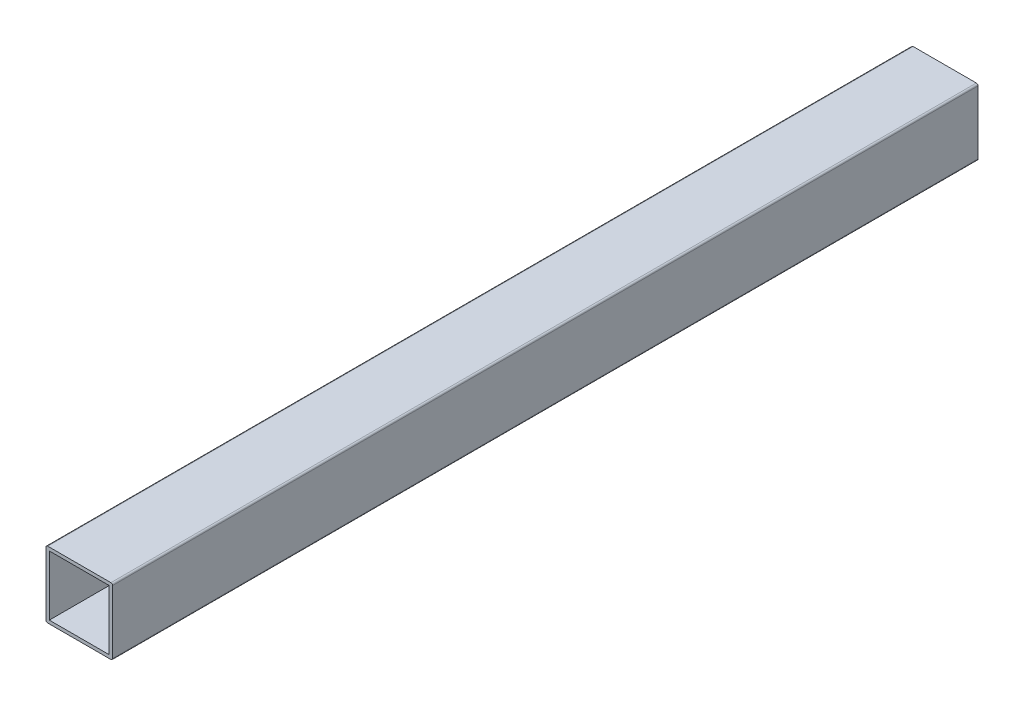
ISO-10303-21;
HEADER;
FILE_DESCRIPTION(('STEP AP214'),'2;1');
FILE_NAME('part.step','',(''),(''),'','','');
FILE_SCHEMA(('AUTOMOTIVE_DESIGN { 1 0 10303 214 1 1 1 1 }'));
ENDSEC;
DATA;
#1=APPLICATION_CONTEXT('core data for automotive mechanical design processes');
#2=APPLICATION_PROTOCOL_DEFINITION('international standard','automotive_design',2000,#1);
#3=PRODUCT_CONTEXT('',#1,'mechanical');
#4=PRODUCT('Part','Part','',(#3));
#5=PRODUCT_RELATED_PRODUCT_CATEGORY('part','',(#4));
#6=PRODUCT_DEFINITION_FORMATION('','',#4);
#7=PRODUCT_DEFINITION_CONTEXT('part definition',#1,'design');
#8=PRODUCT_DEFINITION('design','',#6,#7);
#9=PRODUCT_DEFINITION_SHAPE('','',#8);
#10=(LENGTH_UNIT() NAMED_UNIT(*) SI_UNIT(.MILLI.,.METRE.));
#11=(NAMED_UNIT(*) PLANE_ANGLE_UNIT() SI_UNIT($,.RADIAN.));
#12=(NAMED_UNIT(*) SI_UNIT($,.STERADIAN.) SOLID_ANGLE_UNIT());
#13=UNCERTAINTY_MEASURE_WITH_UNIT(LENGTH_MEASURE(1.E-05),#10,'distance_accuracy_value','');
#14=(GEOMETRIC_REPRESENTATION_CONTEXT(3) GLOBAL_UNCERTAINTY_ASSIGNED_CONTEXT((#13)) GLOBAL_UNIT_ASSIGNED_CONTEXT((#10,
#11,#12)) REPRESENTATION_CONTEXT('',''));
#15=CARTESIAN_POINT('',(0.,0.,0.));
#16=DIRECTION('',(0.,0.,1.));
#17=DIRECTION('',(1.,0.,0.));
#18=AXIS2_PLACEMENT_3D('',#15,#16,#17);
#19=CARTESIAN_POINT('',(-9.5,-9.5,260.));
#20=DIRECTION('',(0.,0.,1.));
#21=DIRECTION('',(1.,0.,0.));
#22=AXIS2_PLACEMENT_3D('',#19,#20,#21);
#23=PLANE('',#22);
#24=CARTESIAN_POINT('',(-9.5,-9.5,260.));
#25=DIRECTION('',(0.,0.,1.));
#26=DIRECTION('',(-1.,0.,0.));
#27=AXIS2_PLACEMENT_3D('',#24,#25,#26);
#28=CIRCLE('',#27,0.5);
#29=CARTESIAN_POINT('',(-10.,-9.49999999999999,260.));
#30=VERTEX_POINT('',#29);
#31=CARTESIAN_POINT('',(-9.49999999999999,-10.,260.));
#32=VERTEX_POINT('',#31);
#33=EDGE_CURVE('E197',#30,#32,#28,.T.);
#34=ORIENTED_EDGE('',*,*,#33,.T.);
#35=DIRECTION('',(1.,0.,0.));
#36=VECTOR('',#35,1.);
#37=CARTESIAN_POINT('',(-9.49999999999999,-10.,260.));
#38=LINE('',#37,#36);
#39=CARTESIAN_POINT('',(9.5,-10.,260.));
#40=VERTEX_POINT('',#39);
#41=EDGE_CURVE('E200',#32,#40,#38,.T.);
#42=ORIENTED_EDGE('',*,*,#41,.T.);
#43=CARTESIAN_POINT('',(9.5,-9.5,260.));
#44=DIRECTION('',(0.,0.,1.));
#45=DIRECTION('',(1.,0.,0.));
#46=AXIS2_PLACEMENT_3D('',#43,#44,#45);
#47=CIRCLE('',#46,0.5);
#48=CARTESIAN_POINT('',(10.,-9.5,260.));
#49=VERTEX_POINT('',#48);
#50=EDGE_CURVE('E203',#40,#49,#47,.T.);
#51=ORIENTED_EDGE('',*,*,#50,.T.);
#52=DIRECTION('',(0.,1.,0.));
#53=VECTOR('',#52,1.);
#54=CARTESIAN_POINT('',(10.,-9.49999999999999,260.));
#55=LINE('',#54,#53);
#56=CARTESIAN_POINT('',(10.,9.5,260.));
#57=VERTEX_POINT('',#56);
#58=EDGE_CURVE('E205',#49,#57,#55,.T.);
#59=ORIENTED_EDGE('',*,*,#58,.T.);
#60=CARTESIAN_POINT('',(9.5,9.5,260.));
#61=DIRECTION('',(0.,0.,1.));
#62=DIRECTION('',(-1.,0.,0.));
#63=AXIS2_PLACEMENT_3D('',#60,#61,#62);
#64=CIRCLE('',#63,0.5);
#65=CARTESIAN_POINT('',(9.5,10.,260.));
#66=VERTEX_POINT('',#65);
#67=EDGE_CURVE('E207',#57,#66,#64,.T.);
#68=ORIENTED_EDGE('',*,*,#67,.T.);
#69=DIRECTION('',(-1.,0.,0.));
#70=VECTOR('',#69,1.);
#71=CARTESIAN_POINT('',(-9.49999999999999,10.,260.));
#72=LINE('',#71,#70);
#73=CARTESIAN_POINT('',(-9.49999999999999,10.,260.));
#74=VERTEX_POINT('',#73);
#75=EDGE_CURVE('E209',#66,#74,#72,.T.);
#76=ORIENTED_EDGE('',*,*,#75,.T.);
#77=CARTESIAN_POINT('',(-9.5,9.5,260.));
#78=DIRECTION('',(0.,0.,1.));
#79=DIRECTION('',(-1.,0.,0.));
#80=AXIS2_PLACEMENT_3D('',#77,#78,#79);
#81=CIRCLE('',#80,0.5);
#82=CARTESIAN_POINT('',(-10.,9.5,260.));
#83=VERTEX_POINT('',#82);
#84=EDGE_CURVE('E211',#74,#83,#81,.T.);
#85=ORIENTED_EDGE('',*,*,#84,.T.);
#86=DIRECTION('',(0.,-1.,0.));
#87=VECTOR('',#86,1.);
#88=CARTESIAN_POINT('',(-10.,-9.49999999999999,260.));
#89=LINE('',#88,#87);
#90=EDGE_CURVE('E213',#83,#30,#89,.T.);
#91=ORIENTED_EDGE('',*,*,#90,.T.);
#92=EDGE_LOOP('',(#34,#42,#51,#59,#68,#76,#85,#91));
#93=FACE_BOUND('',#92,.T.);
#94=DIRECTION('',(1.,0.,0.));
#95=VECTOR('',#94,1.);
#96=CARTESIAN_POINT('',(-9.5,-9.,260.));
#97=LINE('',#96,#95);
#98=CARTESIAN_POINT('',(-9.,-9.,260.));
#99=VERTEX_POINT('',#98);
#100=CARTESIAN_POINT('',(9.,-9.,260.));
#101=VERTEX_POINT('',#100);
#102=EDGE_CURVE('E168',#99,#101,#97,.T.);
#103=ORIENTED_EDGE('',*,*,#102,.F.);
#104=DIRECTION('',(0.,-1.,0.));
#105=VECTOR('',#104,1.);
#106=CARTESIAN_POINT('',(-9.,-9.5,260.));
#107=LINE('',#106,#105);
#108=CARTESIAN_POINT('',(-9.,9.,260.));
#109=VERTEX_POINT('',#108);
#110=EDGE_CURVE('E160',#109,#99,#107,.T.);
#111=ORIENTED_EDGE('',*,*,#110,.F.);
#112=DIRECTION('',(-1.,0.,0.));
#113=VECTOR('',#112,1.);
#114=CARTESIAN_POINT('',(-9.5,9.,260.));
#115=LINE('',#114,#113);
#116=CARTESIAN_POINT('',(9.,9.,260.));
#117=VERTEX_POINT('',#116);
#118=EDGE_CURVE('E182',#117,#109,#115,.T.);
#119=ORIENTED_EDGE('',*,*,#118,.F.);
#120=DIRECTION('',(0.,1.,0.));
#121=VECTOR('',#120,1.);
#122=CARTESIAN_POINT('',(9.,-9.5,260.));
#123=LINE('',#122,#121);
#124=EDGE_CURVE('E180',#101,#117,#123,.T.);
#125=ORIENTED_EDGE('',*,*,#124,.F.);
#126=EDGE_LOOP('',(#103,#111,#119,#125));
#127=FACE_BOUND('',#126,.T.);
#128=ADVANCED_FACE('F69',(#93,#127),#23,.T.);
#129=CARTESIAN_POINT('',(-9.5,-9.5,0.));
#130=DIRECTION('',(0.,0.,1.));
#131=DIRECTION('',(1.,0.,0.));
#132=AXIS2_PLACEMENT_3D('',#129,#130,#131);
#133=PLANE('',#132);
#134=CARTESIAN_POINT('',(-9.5,-9.5,0.));
#135=DIRECTION('',(0.,0.,1.));
#136=DIRECTION('',(-1.,0.,0.));
#137=AXIS2_PLACEMENT_3D('',#134,#135,#136);
#138=CIRCLE('',#137,0.5);
#139=CARTESIAN_POINT('',(-10.,-9.49999999999999,0.));
#140=VERTEX_POINT('',#139);
#141=CARTESIAN_POINT('',(-9.49999999999999,-10.,0.));
#142=VERTEX_POINT('',#141);
#143=EDGE_CURVE('E176',#140,#142,#138,.T.);
#144=ORIENTED_EDGE('',*,*,#143,.F.);
#145=DIRECTION('',(0.,-1.,0.));
#146=VECTOR('',#145,1.);
#147=CARTESIAN_POINT('',(-10.,-9.49999999999999,0.));
#148=LINE('',#147,#146);
#149=CARTESIAN_POINT('',(-10.,9.5,0.));
#150=VERTEX_POINT('',#149);
#151=EDGE_CURVE('E201',#150,#140,#148,.T.);
#152=ORIENTED_EDGE('',*,*,#151,.F.);
#153=CARTESIAN_POINT('',(-9.5,9.5,0.));
#154=DIRECTION('',(0.,0.,1.));
#155=DIRECTION('',(-1.,0.,0.));
#156=AXIS2_PLACEMENT_3D('',#153,#154,#155);
#157=CIRCLE('',#156,0.5);
#158=CARTESIAN_POINT('',(-9.49999999999999,10.,0.));
#159=VERTEX_POINT('',#158);
#160=EDGE_CURVE('E228',#159,#150,#157,.T.);
#161=ORIENTED_EDGE('',*,*,#160,.F.);
#162=DIRECTION('',(-1.,0.,0.));
#163=VECTOR('',#162,1.);
#164=CARTESIAN_POINT('',(-9.49999999999999,10.,0.));
#165=LINE('',#164,#163);
#166=CARTESIAN_POINT('',(9.5,10.,0.));
#167=VERTEX_POINT('',#166);
#168=EDGE_CURVE('E226',#167,#159,#165,.T.);
#169=ORIENTED_EDGE('',*,*,#168,.F.);
#170=CARTESIAN_POINT('',(9.5,9.5,0.));
#171=DIRECTION('',(0.,0.,1.));
#172=DIRECTION('',(-1.,0.,0.));
#173=AXIS2_PLACEMENT_3D('',#170,#171,#172);
#174=CIRCLE('',#173,0.5);
#175=CARTESIAN_POINT('',(10.,9.5,0.));
#176=VERTEX_POINT('',#175);
#177=EDGE_CURVE('E224',#176,#167,#174,.T.);
#178=ORIENTED_EDGE('',*,*,#177,.F.);
#179=DIRECTION('',(0.,1.,0.));
#180=VECTOR('',#179,1.);
#181=CARTESIAN_POINT('',(10.,-9.49999999999999,0.));
#182=LINE('',#181,#180);
#183=CARTESIAN_POINT('',(10.,-9.5,0.));
#184=VERTEX_POINT('',#183);
#185=EDGE_CURVE('E222',#184,#176,#182,.T.);
#186=ORIENTED_EDGE('',*,*,#185,.F.);
#187=CARTESIAN_POINT('',(9.5,-9.5,0.));
#188=DIRECTION('',(0.,0.,1.));
#189=DIRECTION('',(1.,0.,0.));
#190=AXIS2_PLACEMENT_3D('',#187,#188,#189);
#191=CIRCLE('',#190,0.5);
#192=CARTESIAN_POINT('',(9.5,-10.,0.));
#193=VERTEX_POINT('',#192);
#194=EDGE_CURVE('E220',#193,#184,#191,.T.);
#195=ORIENTED_EDGE('',*,*,#194,.F.);
#196=DIRECTION('',(1.,0.,0.));
#197=VECTOR('',#196,1.);
#198=CARTESIAN_POINT('',(-9.49999999999999,-10.,0.));
#199=LINE('',#198,#197);
#200=EDGE_CURVE('E218',#142,#193,#199,.T.);
#201=ORIENTED_EDGE('',*,*,#200,.F.);
#202=EDGE_LOOP('',(#144,#152,#161,#169,#178,#186,#195,#201));
#203=FACE_BOUND('',#202,.T.);
#204=DIRECTION('',(0.,-1.,0.));
#205=VECTOR('',#204,1.);
#206=CARTESIAN_POINT('',(-9.,-9.5,0.));
#207=LINE('',#206,#205);
#208=CARTESIAN_POINT('',(-9.,9.,0.));
#209=VERTEX_POINT('',#208);
#210=CARTESIAN_POINT('',(-9.,-9.,0.));
#211=VERTEX_POINT('',#210);
#212=EDGE_CURVE('E94',#209,#211,#207,.T.);
#213=ORIENTED_EDGE('',*,*,#212,.T.);
#214=DIRECTION('',(1.,0.,0.));
#215=VECTOR('',#214,1.);
#216=CARTESIAN_POINT('',(-9.5,-9.,0.));
#217=LINE('',#216,#215);
#218=CARTESIAN_POINT('',(9.,-9.,0.));
#219=VERTEX_POINT('',#218);
#220=EDGE_CURVE('E175',#211,#219,#217,.T.);
#221=ORIENTED_EDGE('',*,*,#220,.T.);
#222=DIRECTION('',(0.,1.,0.));
#223=VECTOR('',#222,1.);
#224=CARTESIAN_POINT('',(9.,-9.5,0.));
#225=LINE('',#224,#223);
#226=CARTESIAN_POINT('',(9.,9.,0.));
#227=VERTEX_POINT('',#226);
#228=EDGE_CURVE('E189',#219,#227,#225,.T.);
#229=ORIENTED_EDGE('',*,*,#228,.T.);
#230=DIRECTION('',(-1.,0.,0.));
#231=VECTOR('',#230,1.);
#232=CARTESIAN_POINT('',(-9.5,9.,0.));
#233=LINE('',#232,#231);
#234=EDGE_CURVE('E169',#227,#209,#233,.T.);
#235=ORIENTED_EDGE('',*,*,#234,.T.);
#236=EDGE_LOOP('',(#213,#221,#229,#235));
#237=FACE_BOUND('',#236,.T.);
#238=ADVANCED_FACE('F314',(#203,#237),#133,.F.);
#239=CARTESIAN_POINT('',(-9.5,-9.5,260.));
#240=DIRECTION('',(0.,0.,-1.));
#241=DIRECTION('',(-1.,0.,0.));
#242=AXIS2_PLACEMENT_3D('',#239,#240,#241);
#243=CYLINDRICAL_SURFACE('',#242,0.5);
#244=ORIENTED_EDGE('',*,*,#143,.T.);
#245=DIRECTION('',(0.,0.,-1.));
#246=VECTOR('',#245,1.);
#247=CARTESIAN_POINT('',(-9.49999999999999,-10.,260.));
#248=LINE('',#247,#246);
#249=EDGE_CURVE('E12',#32,#142,#248,.T.);
#250=ORIENTED_EDGE('',*,*,#249,.F.);
#251=ORIENTED_EDGE('',*,*,#33,.F.);
#252=DIRECTION('',(0.,0.,-1.));
#253=VECTOR('',#252,1.);
#254=CARTESIAN_POINT('',(-10.,-9.49999999999999,260.));
#255=LINE('',#254,#253);
#256=EDGE_CURVE('E215',#30,#140,#255,.T.);
#257=ORIENTED_EDGE('',*,*,#256,.T.);
#258=EDGE_LOOP('',(#244,#250,#251,#257));
#259=FACE_BOUND('',#258,.T.);
#260=ADVANCED_FACE('F71',(#259),#243,.T.);
#261=CARTESIAN_POINT('',(-9.49999999999999,-10.,260.));
#262=DIRECTION('',(0.,1.,0.));
#263=DIRECTION('',(0.,0.,1.));
#264=AXIS2_PLACEMENT_3D('',#261,#262,#263);
#265=PLANE('',#264);
#266=ORIENTED_EDGE('',*,*,#200,.T.);
#267=DIRECTION('',(0.,0.,-1.));
#268=VECTOR('',#267,1.);
#269=CARTESIAN_POINT('',(9.5,-10.,260.));
#270=LINE('',#269,#268);
#271=EDGE_CURVE('E78',#40,#193,#270,.T.);
#272=ORIENTED_EDGE('',*,*,#271,.F.);
#273=ORIENTED_EDGE('',*,*,#41,.F.);
#274=ORIENTED_EDGE('',*,*,#249,.T.);
#275=EDGE_LOOP('',(#266,#272,#273,#274));
#276=FACE_BOUND('',#275,.T.);
#277=ADVANCED_FACE('F320',(#276),#265,.F.);
#278=CARTESIAN_POINT('',(9.5,-9.5,260.));
#279=DIRECTION('',(0.,0.,-1.));
#280=DIRECTION('',(-1.,0.,0.));
#281=AXIS2_PLACEMENT_3D('',#278,#279,#280);
#282=CYLINDRICAL_SURFACE('',#281,0.5);
#283=ORIENTED_EDGE('',*,*,#194,.T.);
#284=DIRECTION('',(0.,0.,-1.));
#285=VECTOR('',#284,1.);
#286=CARTESIAN_POINT('',(10.,-9.5,260.));
#287=LINE('',#286,#285);
#288=EDGE_CURVE('E245',#49,#184,#287,.T.);
#289=ORIENTED_EDGE('',*,*,#288,.F.);
#290=ORIENTED_EDGE('',*,*,#50,.F.);
#291=ORIENTED_EDGE('',*,*,#271,.T.);
#292=EDGE_LOOP('',(#283,#289,#290,#291));
#293=FACE_BOUND('',#292,.T.);
#294=ADVANCED_FACE('F341',(#293),#282,.T.);
#295=CARTESIAN_POINT('',(10.,-9.49999999999999,260.));
#296=DIRECTION('',(-1.,0.,0.));
#297=DIRECTION('',(0.,0.,1.));
#298=AXIS2_PLACEMENT_3D('',#295,#296,#297);
#299=PLANE('',#298);
#300=ORIENTED_EDGE('',*,*,#185,.T.);
#301=DIRECTION('',(0.,0.,-1.));
#302=VECTOR('',#301,1.);
#303=CARTESIAN_POINT('',(10.,9.5,260.));
#304=LINE('',#303,#302);
#305=EDGE_CURVE('E242',#57,#176,#304,.T.);
#306=ORIENTED_EDGE('',*,*,#305,.F.);
#307=ORIENTED_EDGE('',*,*,#58,.F.);
#308=ORIENTED_EDGE('',*,*,#288,.T.);
#309=EDGE_LOOP('',(#300,#306,#307,#308));
#310=FACE_BOUND('',#309,.T.);
#311=ADVANCED_FACE('F338',(#310),#299,.F.);
#312=CARTESIAN_POINT('',(9.5,9.5,260.));
#313=DIRECTION('',(0.,0.,-1.));
#314=DIRECTION('',(-1.,0.,0.));
#315=AXIS2_PLACEMENT_3D('',#312,#313,#314);
#316=CYLINDRICAL_SURFACE('',#315,0.5);
#317=ORIENTED_EDGE('',*,*,#177,.T.);
#318=DIRECTION('',(0.,0.,-1.));
#319=VECTOR('',#318,1.);
#320=CARTESIAN_POINT('',(9.5,10.,260.));
#321=LINE('',#320,#319);
#322=EDGE_CURVE('E239',#66,#167,#321,.T.);
#323=ORIENTED_EDGE('',*,*,#322,.F.);
#324=ORIENTED_EDGE('',*,*,#67,.F.);
#325=ORIENTED_EDGE('',*,*,#305,.T.);
#326=EDGE_LOOP('',(#317,#323,#324,#325));
#327=FACE_BOUND('',#326,.T.);
#328=ADVANCED_FACE('F334',(#327),#316,.T.);
#329=CARTESIAN_POINT('',(-9.49999999999999,10.,260.));
#330=DIRECTION('',(0.,-1.,0.));
#331=DIRECTION('',(0.,0.,-1.));
#332=AXIS2_PLACEMENT_3D('',#329,#330,#331);
#333=PLANE('',#332);
#334=ORIENTED_EDGE('',*,*,#168,.T.);
#335=DIRECTION('',(0.,0.,-1.));
#336=VECTOR('',#335,1.);
#337=CARTESIAN_POINT('',(-9.49999999999999,10.,260.));
#338=LINE('',#337,#336);
#339=EDGE_CURVE('E236',#74,#159,#338,.T.);
#340=ORIENTED_EDGE('',*,*,#339,.F.);
#341=ORIENTED_EDGE('',*,*,#75,.F.);
#342=ORIENTED_EDGE('',*,*,#322,.T.);
#343=EDGE_LOOP('',(#334,#340,#341,#342));
#344=FACE_BOUND('',#343,.T.);
#345=ADVANCED_FACE('F330',(#344),#333,.F.);
#346=CARTESIAN_POINT('',(-9.5,9.5,260.));
#347=DIRECTION('',(0.,0.,-1.));
#348=DIRECTION('',(-1.,0.,0.));
#349=AXIS2_PLACEMENT_3D('',#346,#347,#348);
#350=CYLINDRICAL_SURFACE('',#349,0.5);
#351=ORIENTED_EDGE('',*,*,#160,.T.);
#352=DIRECTION('',(0.,0.,-1.));
#353=VECTOR('',#352,1.);
#354=CARTESIAN_POINT('',(-10.,9.5,260.));
#355=LINE('',#354,#353);
#356=EDGE_CURVE('E233',#83,#150,#355,.T.);
#357=ORIENTED_EDGE('',*,*,#356,.F.);
#358=ORIENTED_EDGE('',*,*,#84,.F.);
#359=ORIENTED_EDGE('',*,*,#339,.T.);
#360=EDGE_LOOP('',(#351,#357,#358,#359));
#361=FACE_BOUND('',#360,.T.);
#362=ADVANCED_FACE('F299',(#361),#350,.T.);
#363=CARTESIAN_POINT('',(-10.,-9.49999999999999,260.));
#364=DIRECTION('',(1.,0.,0.));
#365=DIRECTION('',(0.,0.,-1.));
#366=AXIS2_PLACEMENT_3D('',#363,#364,#365);
#367=PLANE('',#366);
#368=CARTESIAN_POINT('',(-10.,0.,196.));
#369=DIRECTION('',(-1.,0.,0.));
#370=DIRECTION('',(0.,0.,1.));
#371=AXIS2_PLACEMENT_3D('',#368,#369,#370);
#372=CIRCLE('',#371,3.4);
#373=CARTESIAN_POINT('',(-10.,0.,199.4));
#374=VERTEX_POINT('',#373);
#375=EDGE_CURVE('E289',#374,#374,#372,.T.);
#376=ORIENTED_EDGE('',*,*,#375,.F.);
#377=EDGE_LOOP('',(#376));
#378=FACE_BOUND('',#377,.T.);
#379=CARTESIAN_POINT('',(-10.,0.,164.));
#380=DIRECTION('',(-1.,0.,0.));
#381=DIRECTION('',(0.,0.,1.));
#382=AXIS2_PLACEMENT_3D('',#379,#380,#381);
#383=CIRCLE('',#382,3.4);
#384=CARTESIAN_POINT('',(-10.,0.,167.4));
#385=VERTEX_POINT('',#384);
#386=EDGE_CURVE('E286',#385,#385,#383,.T.);
#387=ORIENTED_EDGE('',*,*,#386,.F.);
#388=EDGE_LOOP('',(#387));
#389=FACE_BOUND('',#388,.T.);
#390=CARTESIAN_POINT('',(-10.,0.,64.));
#391=DIRECTION('',(-1.,0.,0.));
#392=DIRECTION('',(0.,0.,1.));
#393=AXIS2_PLACEMENT_3D('',#390,#391,#392);
#394=CIRCLE('',#393,3.4);
#395=CARTESIAN_POINT('',(-10.,0.,67.4));
#396=VERTEX_POINT('',#395);
#397=EDGE_CURVE('E284',#396,#396,#394,.T.);
#398=ORIENTED_EDGE('',*,*,#397,.F.);
#399=EDGE_LOOP('',(#398));
#400=FACE_BOUND('',#399,.T.);
#401=CARTESIAN_POINT('',(-10.,0.,96.));
#402=DIRECTION('',(-1.,0.,0.));
#403=DIRECTION('',(0.,0.,1.));
#404=AXIS2_PLACEMENT_3D('',#401,#402,#403);
#405=CIRCLE('',#404,3.4);
#406=CARTESIAN_POINT('',(-10.,0.,99.4));
#407=VERTEX_POINT('',#406);
#408=EDGE_CURVE('E254',#407,#407,#405,.T.);
#409=ORIENTED_EDGE('',*,*,#408,.F.);
#410=EDGE_LOOP('',(#409));
#411=FACE_BOUND('',#410,.T.);
#412=ORIENTED_EDGE('',*,*,#151,.T.);
#413=ORIENTED_EDGE('',*,*,#256,.F.);
#414=ORIENTED_EDGE('',*,*,#90,.F.);
#415=ORIENTED_EDGE('',*,*,#356,.T.);
#416=EDGE_LOOP('',(#412,#413,#414,#415));
#417=FACE_BOUND('',#416,.T.);
#418=ADVANCED_FACE('F268',(#378,#389,#400,#411,#417),#367,.F.);
#419=CARTESIAN_POINT('',(-9.,-9.5,260.));
#420=DIRECTION('',(1.,0.,0.));
#421=DIRECTION('',(0.,0.,-1.));
#422=AXIS2_PLACEMENT_3D('',#419,#420,#421);
#423=PLANE('',#422);
#424=CARTESIAN_POINT('',(-9.,0.,196.));
#425=DIRECTION('',(1.,0.,0.));
#426=DIRECTION('',(0.,0.,-1.));
#427=AXIS2_PLACEMENT_3D('',#424,#425,#426);
#428=CIRCLE('',#427,3.4);
#429=CARTESIAN_POINT('',(-9.,0.,192.6));
#430=VERTEX_POINT('',#429);
#431=EDGE_CURVE('E73',#430,#430,#428,.T.);
#432=ORIENTED_EDGE('',*,*,#431,.F.);
#433=EDGE_LOOP('',(#432));
#434=FACE_BOUND('',#433,.T.);
#435=CARTESIAN_POINT('',(-9.,0.,164.));
#436=DIRECTION('',(1.,0.,0.));
#437=DIRECTION('',(0.,0.,-1.));
#438=AXIS2_PLACEMENT_3D('',#435,#436,#437);
#439=CIRCLE('',#438,3.4);
#440=CARTESIAN_POINT('',(-9.,0.,160.6));
#441=VERTEX_POINT('',#440);
#442=EDGE_CURVE('E256',#441,#441,#439,.T.);
#443=ORIENTED_EDGE('',*,*,#442,.F.);
#444=EDGE_LOOP('',(#443));
#445=FACE_BOUND('',#444,.T.);
#446=CARTESIAN_POINT('',(-9.,0.,64.));
#447=DIRECTION('',(1.,0.,0.));
#448=DIRECTION('',(0.,0.,-1.));
#449=AXIS2_PLACEMENT_3D('',#446,#447,#448);
#450=CIRCLE('',#449,3.4);
#451=CARTESIAN_POINT('',(-9.,0.,60.6));
#452=VERTEX_POINT('',#451);
#453=EDGE_CURVE('E253',#452,#452,#450,.T.);
#454=ORIENTED_EDGE('',*,*,#453,.F.);
#455=EDGE_LOOP('',(#454));
#456=FACE_BOUND('',#455,.T.);
#457=CARTESIAN_POINT('',(-9.,0.,96.));
#458=DIRECTION('',(1.,0.,0.));
#459=DIRECTION('',(0.,0.,-1.));
#460=AXIS2_PLACEMENT_3D('',#457,#458,#459);
#461=CIRCLE('',#460,3.4);
#462=CARTESIAN_POINT('',(-9.,0.,92.6));
#463=VERTEX_POINT('',#462);
#464=EDGE_CURVE('E250',#463,#463,#461,.T.);
#465=ORIENTED_EDGE('',*,*,#464,.F.);
#466=EDGE_LOOP('',(#465));
#467=FACE_BOUND('',#466,.T.);
#468=ORIENTED_EDGE('',*,*,#212,.F.);
#469=DIRECTION('',(0.,0.,-1.));
#470=VECTOR('',#469,1.);
#471=CARTESIAN_POINT('',(-9.,9.,260.));
#472=LINE('',#471,#470);
#473=EDGE_CURVE('E164',#109,#209,#472,.T.);
#474=ORIENTED_EDGE('',*,*,#473,.F.);
#475=ORIENTED_EDGE('',*,*,#110,.T.);
#476=DIRECTION('',(0.,0.,-1.));
#477=VECTOR('',#476,1.);
#478=CARTESIAN_POINT('',(-9.,-9.,260.));
#479=LINE('',#478,#477);
#480=EDGE_CURVE('E163',#99,#211,#479,.T.);
#481=ORIENTED_EDGE('',*,*,#480,.T.);
#482=EDGE_LOOP('',(#468,#474,#475,#481));
#483=FACE_BOUND('',#482,.T.);
#484=ADVANCED_FACE('F162',(#434,#445,#456,#467,#483),#423,.T.);
#485=CARTESIAN_POINT('',(-9.5,-9.,260.));
#486=DIRECTION('',(0.,1.,0.));
#487=DIRECTION('',(0.,0.,1.));
#488=AXIS2_PLACEMENT_3D('',#485,#486,#487);
#489=PLANE('',#488);
#490=ORIENTED_EDGE('',*,*,#220,.F.);
#491=ORIENTED_EDGE('',*,*,#480,.F.);
#492=ORIENTED_EDGE('',*,*,#102,.T.);
#493=DIRECTION('',(0.,0.,-1.));
#494=VECTOR('',#493,1.);
#495=CARTESIAN_POINT('',(9.,-9.,260.));
#496=LINE('',#495,#494);
#497=EDGE_CURVE('E177',#101,#219,#496,.T.);
#498=ORIENTED_EDGE('',*,*,#497,.T.);
#499=EDGE_LOOP('',(#490,#491,#492,#498));
#500=FACE_BOUND('',#499,.T.);
#501=ADVANCED_FACE('F172',(#500),#489,.T.);
#502=CARTESIAN_POINT('',(9.,-9.5,260.));
#503=DIRECTION('',(-1.,0.,0.));
#504=DIRECTION('',(0.,0.,1.));
#505=AXIS2_PLACEMENT_3D('',#502,#503,#504);
#506=PLANE('',#505);
#507=ORIENTED_EDGE('',*,*,#228,.F.);
#508=ORIENTED_EDGE('',*,*,#497,.F.);
#509=ORIENTED_EDGE('',*,*,#124,.T.);
#510=DIRECTION('',(0.,0.,-1.));
#511=VECTOR('',#510,1.);
#512=CARTESIAN_POINT('',(9.,9.,260.));
#513=LINE('',#512,#511);
#514=EDGE_CURVE('E86',#117,#227,#513,.T.);
#515=ORIENTED_EDGE('',*,*,#514,.T.);
#516=EDGE_LOOP('',(#507,#508,#509,#515));
#517=FACE_BOUND('',#516,.T.);
#518=ADVANCED_FACE('F390',(#517),#506,.T.);
#519=CARTESIAN_POINT('',(-9.5,9.,260.));
#520=DIRECTION('',(0.,-1.,0.));
#521=DIRECTION('',(0.,0.,-1.));
#522=AXIS2_PLACEMENT_3D('',#519,#520,#521);
#523=PLANE('',#522);
#524=ORIENTED_EDGE('',*,*,#234,.F.);
#525=ORIENTED_EDGE('',*,*,#514,.F.);
#526=ORIENTED_EDGE('',*,*,#118,.T.);
#527=ORIENTED_EDGE('',*,*,#473,.T.);
#528=EDGE_LOOP('',(#524,#525,#526,#527));
#529=FACE_BOUND('',#528,.T.);
#530=ADVANCED_FACE('F279',(#529),#523,.T.);
#531=CARTESIAN_POINT('',(0.,0.,96.));
#532=DIRECTION('',(-1.,0.,0.));
#533=DIRECTION('',(0.,0.,1.));
#534=AXIS2_PLACEMENT_3D('',#531,#532,#533);
#535=CYLINDRICAL_SURFACE('',#534,3.4);
#536=ORIENTED_EDGE('',*,*,#464,.T.);
#537=EDGE_LOOP('',(#536));
#538=FACE_BOUND('',#537,.T.);
#539=ORIENTED_EDGE('',*,*,#408,.T.);
#540=EDGE_LOOP('',(#539));
#541=FACE_BOUND('',#540,.T.);
#542=ADVANCED_FACE('F275',(#538,#541),#535,.F.);
#543=CARTESIAN_POINT('',(0.,0.,64.));
#544=DIRECTION('',(-1.,0.,0.));
#545=DIRECTION('',(0.,0.,1.));
#546=AXIS2_PLACEMENT_3D('',#543,#544,#545);
#547=CYLINDRICAL_SURFACE('',#546,3.4);
#548=ORIENTED_EDGE('',*,*,#453,.T.);
#549=EDGE_LOOP('',(#548));
#550=FACE_BOUND('',#549,.T.);
#551=ORIENTED_EDGE('',*,*,#397,.T.);
#552=EDGE_LOOP('',(#551));
#553=FACE_BOUND('',#552,.T.);
#554=ADVANCED_FACE('F278',(#550,#553),#547,.F.);
#555=CARTESIAN_POINT('',(0.,0.,164.));
#556=DIRECTION('',(-1.,0.,0.));
#557=DIRECTION('',(0.,0.,1.));
#558=AXIS2_PLACEMENT_3D('',#555,#556,#557);
#559=CYLINDRICAL_SURFACE('',#558,3.4);
#560=ORIENTED_EDGE('',*,*,#442,.T.);
#561=EDGE_LOOP('',(#560));
#562=FACE_BOUND('',#561,.T.);
#563=ORIENTED_EDGE('',*,*,#386,.T.);
#564=EDGE_LOOP('',(#563));
#565=FACE_BOUND('',#564,.T.);
#566=ADVANCED_FACE('F295',(#562,#565),#559,.F.);
#567=CARTESIAN_POINT('',(0.,0.,196.));
#568=DIRECTION('',(-1.,0.,0.));
#569=DIRECTION('',(0.,0.,1.));
#570=AXIS2_PLACEMENT_3D('',#567,#568,#569);
#571=CYLINDRICAL_SURFACE('',#570,3.4);
#572=ORIENTED_EDGE('',*,*,#431,.T.);
#573=EDGE_LOOP('',(#572));
#574=FACE_BOUND('',#573,.T.);
#575=ORIENTED_EDGE('',*,*,#375,.T.);
#576=EDGE_LOOP('',(#575));
#577=FACE_BOUND('',#576,.T.);
#578=ADVANCED_FACE('F263',(#574,#577),#571,.F.);
#579=CLOSED_SHELL('',(#128,#238,#260,#277,#294,#311,#328,#345,#362,#418,#484,#501,#518,#530,
#542,#554,#566,#578));
#580=MANIFOLD_SOLID_BREP('B2',#579);
#581=ADVANCED_BREP_SHAPE_REPRESENTATION('',(#18,#580),#14);
#582=SHAPE_DEFINITION_REPRESENTATION(#9,#581);
ENDSEC;
END-ISO-10303-21;
